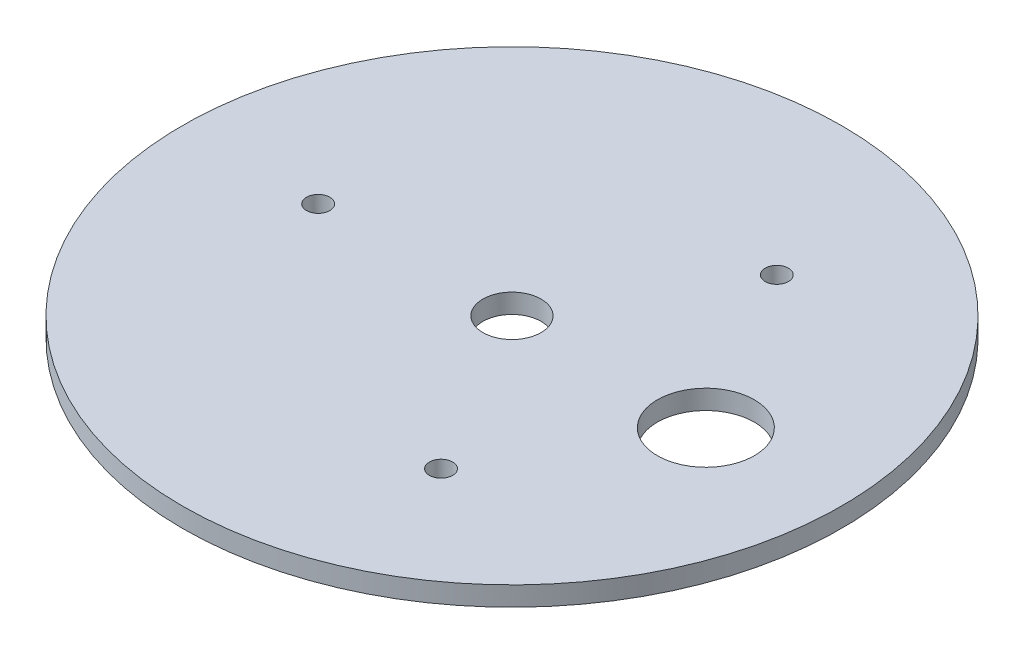
ISO-10303-21;
HEADER;
FILE_DESCRIPTION(('STEP AP214'),'2;1');
FILE_NAME('part.step','',(''),(''),'','','');
FILE_SCHEMA(('AUTOMOTIVE_DESIGN { 1 0 10303 214 1 1 1 1 }'));
ENDSEC;
DATA;
#1=APPLICATION_CONTEXT('core data for automotive mechanical design processes');
#2=APPLICATION_PROTOCOL_DEFINITION('international standard','automotive_design',2000,#1);
#3=PRODUCT_CONTEXT('',#1,'mechanical');
#4=PRODUCT('Part','Part','',(#3));
#5=PRODUCT_RELATED_PRODUCT_CATEGORY('part','',(#4));
#6=PRODUCT_DEFINITION_FORMATION('','',#4);
#7=PRODUCT_DEFINITION_CONTEXT('part definition',#1,'design');
#8=PRODUCT_DEFINITION('design','',#6,#7);
#9=PRODUCT_DEFINITION_SHAPE('','',#8);
#10=(LENGTH_UNIT() NAMED_UNIT(*) SI_UNIT(.MILLI.,.METRE.));
#11=(NAMED_UNIT(*) PLANE_ANGLE_UNIT() SI_UNIT($,.RADIAN.));
#12=(NAMED_UNIT(*) SI_UNIT($,.STERADIAN.) SOLID_ANGLE_UNIT());
#13=UNCERTAINTY_MEASURE_WITH_UNIT(LENGTH_MEASURE(1.E-05),#10,'distance_accuracy_value','');
#14=(GEOMETRIC_REPRESENTATION_CONTEXT(3) GLOBAL_UNCERTAINTY_ASSIGNED_CONTEXT((#13)) GLOBAL_UNIT_ASSIGNED_CONTEXT((#10,
#11,#12)) REPRESENTATION_CONTEXT('',''));
#15=CARTESIAN_POINT('',(0.,0.,0.));
#16=DIRECTION('',(0.,0.,1.));
#17=DIRECTION('',(1.,0.,0.));
#18=AXIS2_PLACEMENT_3D('',#15,#16,#17);
#19=CARTESIAN_POINT('',(-85.,4.99999999999999,0.));
#20=DIRECTION('',(0.,-1.,0.));
#21=DIRECTION('',(0.,0.,-1.));
#22=AXIS2_PLACEMENT_3D('',#19,#20,#21);
#23=PLANE('',#22);
#24=CARTESIAN_POINT('',(25.0000000000002,4.99999999999999,-43.3012701892218));
#25=DIRECTION('',(0.,-1.,0.));
#26=DIRECTION('',(0.,0.,-1.));
#27=AXIS2_PLACEMENT_3D('',#24,#25,#26);
#28=CIRCLE('',#27,3.);
#29=CARTESIAN_POINT('',(25.0000000000002,4.99999999999999,-46.3012701892218));
#30=VERTEX_POINT('',#29);
#31=EDGE_CURVE('E63',#30,#30,#28,.F.);
#32=ORIENTED_EDGE('',*,*,#31,.F.);
#33=EDGE_LOOP('',(#32));
#34=FACE_BOUND('',#33,.T.);
#35=CARTESIAN_POINT('',(0.,4.99999999999999,0.));
#36=DIRECTION('',(0.,-1.,0.));
#37=DIRECTION('',(0.,0.,-1.));
#38=AXIS2_PLACEMENT_3D('',#35,#36,#37);
#39=CIRCLE('',#38,7.5);
#40=CARTESIAN_POINT('',(0.,4.99999999999999,-7.5));
#41=VERTEX_POINT('',#40);
#42=EDGE_CURVE('E51',#41,#41,#39,.F.);
#43=ORIENTED_EDGE('',*,*,#42,.F.);
#44=EDGE_LOOP('',(#43));
#45=FACE_BOUND('',#44,.T.);
#46=CARTESIAN_POINT('',(0.,4.99999999999999,0.));
#47=DIRECTION('',(0.,-1.,0.));
#48=DIRECTION('',(0.,0.,-1.));
#49=AXIS2_PLACEMENT_3D('',#46,#47,#48);
#50=CIRCLE('',#49,85.);
#51=CARTESIAN_POINT('',(0.,4.99999999999999,-85.));
#52=VERTEX_POINT('',#51);
#53=EDGE_CURVE('E10',#52,#52,#50,.T.);
#54=ORIENTED_EDGE('',*,*,#53,.F.);
#55=EDGE_LOOP('',(#54));
#56=FACE_BOUND('',#55,.T.);
#57=CARTESIAN_POINT('',(50.,4.99999999999999,0.));
#58=DIRECTION('',(0.,-1.,0.));
#59=DIRECTION('',(0.,0.,-1.));
#60=AXIS2_PLACEMENT_3D('',#57,#58,#59);
#61=CIRCLE('',#60,12.5);
#62=CARTESIAN_POINT('',(50.,4.99999999999999,-12.5));
#63=VERTEX_POINT('',#62);
#64=EDGE_CURVE('E42',#63,#63,#61,.F.);
#65=ORIENTED_EDGE('',*,*,#64,.F.);
#66=EDGE_LOOP('',(#65));
#67=FACE_BOUND('',#66,.T.);
#68=CARTESIAN_POINT('',(-50.,4.99999999999999,0.));
#69=DIRECTION('',(0.,-1.,0.));
#70=DIRECTION('',(0.,0.,-1.));
#71=AXIS2_PLACEMENT_3D('',#68,#69,#70);
#72=CIRCLE('',#71,3.);
#73=CARTESIAN_POINT('',(-50.,4.99999999999999,-3.));
#74=VERTEX_POINT('',#73);
#75=EDGE_CURVE('E57',#74,#74,#72,.F.);
#76=ORIENTED_EDGE('',*,*,#75,.F.);
#77=EDGE_LOOP('',(#76));
#78=FACE_BOUND('',#77,.T.);
#79=CARTESIAN_POINT('',(24.9999999999996,4.99999999999999,43.3012701892222));
#80=DIRECTION('',(0.,-1.,0.));
#81=DIRECTION('',(0.,0.,-1.));
#82=AXIS2_PLACEMENT_3D('',#79,#80,#81);
#83=CIRCLE('',#82,3.);
#84=CARTESIAN_POINT('',(24.9999999999996,4.99999999999999,40.3012701892222));
#85=VERTEX_POINT('',#84);
#86=EDGE_CURVE('E69',#85,#85,#83,.F.);
#87=ORIENTED_EDGE('',*,*,#86,.F.);
#88=EDGE_LOOP('',(#87));
#89=FACE_BOUND('',#88,.T.);
#90=ADVANCED_FACE('F32',(#34,#45,#56,#67,#78,#89),#23,.F.);
#91=CARTESIAN_POINT('',(0.,0.,0.));
#92=DIRECTION('',(0.,1.,0.));
#93=DIRECTION('',(0.,0.,1.));
#94=AXIS2_PLACEMENT_3D('',#91,#92,#93);
#95=PLANE('',#94);
#96=CARTESIAN_POINT('',(25.0000000000002,0.,-43.3012701892218));
#97=DIRECTION('',(0.,1.,0.));
#98=DIRECTION('',(0.,0.,1.));
#99=AXIS2_PLACEMENT_3D('',#96,#97,#98);
#100=CIRCLE('',#99,3.);
#101=CARTESIAN_POINT('',(25.0000000000002,0.,-40.3012701892218));
#102=VERTEX_POINT('',#101);
#103=EDGE_CURVE('E66',#102,#102,#100,.T.);
#104=ORIENTED_EDGE('',*,*,#103,.T.);
#105=EDGE_LOOP('',(#104));
#106=FACE_BOUND('',#105,.T.);
#107=CARTESIAN_POINT('',(0.,0.,0.));
#108=DIRECTION('',(0.,1.,0.));
#109=DIRECTION('',(0.,0.,1.));
#110=AXIS2_PLACEMENT_3D('',#107,#108,#109);
#111=CIRCLE('',#110,7.5);
#112=CARTESIAN_POINT('',(0.,0.,7.5));
#113=VERTEX_POINT('',#112);
#114=EDGE_CURVE('E54',#113,#113,#111,.T.);
#115=ORIENTED_EDGE('',*,*,#114,.T.);
#116=EDGE_LOOP('',(#115));
#117=FACE_BOUND('',#116,.T.);
#118=CARTESIAN_POINT('',(0.,0.,0.));
#119=DIRECTION('',(0.,-1.,0.));
#120=DIRECTION('',(0.,0.,-1.));
#121=AXIS2_PLACEMENT_3D('',#118,#119,#120);
#122=CIRCLE('',#121,85.);
#123=CARTESIAN_POINT('',(0.,0.,-85.));
#124=VERTEX_POINT('',#123);
#125=EDGE_CURVE('E38',#124,#124,#122,.T.);
#126=ORIENTED_EDGE('',*,*,#125,.T.);
#127=EDGE_LOOP('',(#126));
#128=FACE_BOUND('',#127,.T.);
#129=CARTESIAN_POINT('',(50.,0.,0.));
#130=DIRECTION('',(0.,1.,0.));
#131=DIRECTION('',(0.,0.,1.));
#132=AXIS2_PLACEMENT_3D('',#129,#130,#131);
#133=CIRCLE('',#132,12.5);
#134=CARTESIAN_POINT('',(50.,0.,12.5));
#135=VERTEX_POINT('',#134);
#136=EDGE_CURVE('E46',#135,#135,#133,.T.);
#137=ORIENTED_EDGE('',*,*,#136,.T.);
#138=EDGE_LOOP('',(#137));
#139=FACE_BOUND('',#138,.T.);
#140=CARTESIAN_POINT('',(-50.,0.,0.));
#141=DIRECTION('',(0.,1.,0.));
#142=DIRECTION('',(0.,0.,1.));
#143=AXIS2_PLACEMENT_3D('',#140,#141,#142);
#144=CIRCLE('',#143,3.);
#145=CARTESIAN_POINT('',(-50.,0.,3.));
#146=VERTEX_POINT('',#145);
#147=EDGE_CURVE('E60',#146,#146,#144,.T.);
#148=ORIENTED_EDGE('',*,*,#147,.T.);
#149=EDGE_LOOP('',(#148));
#150=FACE_BOUND('',#149,.T.);
#151=CARTESIAN_POINT('',(24.9999999999996,0.,43.3012701892222));
#152=DIRECTION('',(0.,1.,0.));
#153=DIRECTION('',(0.,0.,1.));
#154=AXIS2_PLACEMENT_3D('',#151,#152,#153);
#155=CIRCLE('',#154,3.);
#156=CARTESIAN_POINT('',(24.9999999999996,0.,46.3012701892222));
#157=VERTEX_POINT('',#156);
#158=EDGE_CURVE('E72',#157,#157,#155,.T.);
#159=ORIENTED_EDGE('',*,*,#158,.T.);
#160=EDGE_LOOP('',(#159));
#161=FACE_BOUND('',#160,.T.);
#162=ADVANCED_FACE('F76',(#106,#117,#128,#139,#150,#161),#95,.F.);
#163=CARTESIAN_POINT('',(0.,0.,0.));
#164=DIRECTION('',(0.,-1.,0.));
#165=DIRECTION('',(0.,0.,-1.));
#166=AXIS2_PLACEMENT_3D('',#163,#164,#165);
#167=CYLINDRICAL_SURFACE('',#166,85.);
#168=ORIENTED_EDGE('',*,*,#125,.F.);
#169=EDGE_LOOP('',(#168));
#170=FACE_BOUND('',#169,.T.);
#171=ORIENTED_EDGE('',*,*,#53,.T.);
#172=EDGE_LOOP('',(#171));
#173=FACE_BOUND('',#172,.T.);
#174=ADVANCED_FACE('F90',(#170,#173),#167,.T.);
#175=CARTESIAN_POINT('',(50.,20.,0.));
#176=DIRECTION('',(0.,-1.,0.));
#177=DIRECTION('',(0.,0.,-1.));
#178=AXIS2_PLACEMENT_3D('',#175,#176,#177);
#179=CYLINDRICAL_SURFACE('',#178,12.5);
#180=ORIENTED_EDGE('',*,*,#136,.F.);
#181=EDGE_LOOP('',(#180));
#182=FACE_BOUND('',#181,.T.);
#183=ORIENTED_EDGE('',*,*,#64,.T.);
#184=EDGE_LOOP('',(#183));
#185=FACE_BOUND('',#184,.T.);
#186=ADVANCED_FACE('F113',(#182,#185),#179,.F.);
#187=CARTESIAN_POINT('',(0.,20.,0.));
#188=DIRECTION('',(0.,-1.,0.));
#189=DIRECTION('',(0.,0.,-1.));
#190=AXIS2_PLACEMENT_3D('',#187,#188,#189);
#191=CYLINDRICAL_SURFACE('',#190,7.5);
#192=ORIENTED_EDGE('',*,*,#114,.F.);
#193=EDGE_LOOP('',(#192));
#194=FACE_BOUND('',#193,.T.);
#195=ORIENTED_EDGE('',*,*,#42,.T.);
#196=EDGE_LOOP('',(#195));
#197=FACE_BOUND('',#196,.T.);
#198=ADVANCED_FACE('F104',(#194,#197),#191,.F.);
#199=CARTESIAN_POINT('',(-50.,20.,0.));
#200=DIRECTION('',(0.,-1.,0.));
#201=DIRECTION('',(0.,0.,-1.));
#202=AXIS2_PLACEMENT_3D('',#199,#200,#201);
#203=CYLINDRICAL_SURFACE('',#202,3.);
#204=ORIENTED_EDGE('',*,*,#147,.F.);
#205=EDGE_LOOP('',(#204));
#206=FACE_BOUND('',#205,.T.);
#207=ORIENTED_EDGE('',*,*,#75,.T.);
#208=EDGE_LOOP('',(#207));
#209=FACE_BOUND('',#208,.T.);
#210=ADVANCED_FACE('F102',(#206,#209),#203,.F.);
#211=CARTESIAN_POINT('',(25.0000000000002,20.,-43.3012701892218));
#212=DIRECTION('',(0.,-1.,0.));
#213=DIRECTION('',(0.,0.,-1.));
#214=AXIS2_PLACEMENT_3D('',#211,#212,#213);
#215=CYLINDRICAL_SURFACE('',#214,3.);
#216=ORIENTED_EDGE('',*,*,#103,.F.);
#217=EDGE_LOOP('',(#216));
#218=FACE_BOUND('',#217,.T.);
#219=ORIENTED_EDGE('',*,*,#31,.T.);
#220=EDGE_LOOP('',(#219));
#221=FACE_BOUND('',#220,.T.);
#222=ADVANCED_FACE('F81',(#218,#221),#215,.F.);
#223=CARTESIAN_POINT('',(24.9999999999996,20.,43.3012701892222));
#224=DIRECTION('',(0.,-1.,0.));
#225=DIRECTION('',(0.,0.,-1.));
#226=AXIS2_PLACEMENT_3D('',#223,#224,#225);
#227=CYLINDRICAL_SURFACE('',#226,3.);
#228=ORIENTED_EDGE('',*,*,#158,.F.);
#229=EDGE_LOOP('',(#228));
#230=FACE_BOUND('',#229,.T.);
#231=ORIENTED_EDGE('',*,*,#86,.T.);
#232=EDGE_LOOP('',(#231));
#233=FACE_BOUND('',#232,.T.);
#234=ADVANCED_FACE('F78',(#230,#233),#227,.F.);
#235=CLOSED_SHELL('',(#90,#162,#174,#186,#198,#210,#222,#234));
#236=MANIFOLD_SOLID_BREP('B2',#235);
#237=ADVANCED_BREP_SHAPE_REPRESENTATION('',(#18,#236),#14);
#238=SHAPE_DEFINITION_REPRESENTATION(#9,#237);
ENDSEC;
END-ISO-10303-21;
